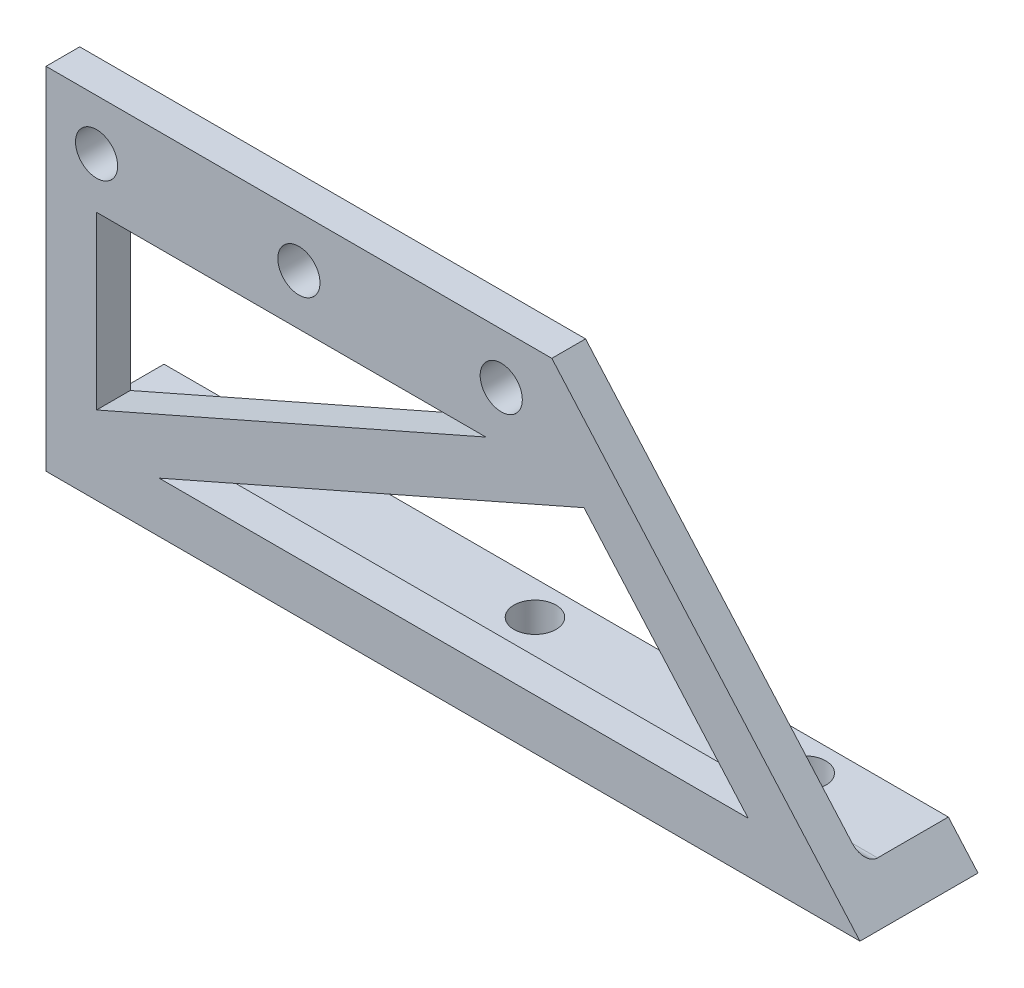
ISO-10303-21;
HEADER;
FILE_DESCRIPTION(('STEP AP214'),'2;1');
FILE_NAME('part.step','',(''),(''),'','','');
FILE_SCHEMA(('AUTOMOTIVE_DESIGN { 1 0 10303 214 1 1 1 1 }'));
ENDSEC;
DATA;
#1=APPLICATION_CONTEXT('core data for automotive mechanical design processes');
#2=APPLICATION_PROTOCOL_DEFINITION('international standard','automotive_design',2000,#1);
#3=PRODUCT_CONTEXT('',#1,'mechanical');
#4=PRODUCT('Part','Part','',(#3));
#5=PRODUCT_RELATED_PRODUCT_CATEGORY('part','',(#4));
#6=PRODUCT_DEFINITION_FORMATION('','',#4);
#7=PRODUCT_DEFINITION_CONTEXT('part definition',#1,'design');
#8=PRODUCT_DEFINITION('design','',#6,#7);
#9=PRODUCT_DEFINITION_SHAPE('','',#8);
#10=(LENGTH_UNIT() NAMED_UNIT(*) SI_UNIT(.MILLI.,.METRE.));
#11=(NAMED_UNIT(*) PLANE_ANGLE_UNIT() SI_UNIT($,.RADIAN.));
#12=(NAMED_UNIT(*) SI_UNIT($,.STERADIAN.) SOLID_ANGLE_UNIT());
#13=UNCERTAINTY_MEASURE_WITH_UNIT(LENGTH_MEASURE(1.E-05),#10,'distance_accuracy_value','');
#14=(GEOMETRIC_REPRESENTATION_CONTEXT(3) GLOBAL_UNCERTAINTY_ASSIGNED_CONTEXT((#13)) GLOBAL_UNIT_ASSIGNED_CONTEXT((#10,
#11,#12)) REPRESENTATION_CONTEXT('',''));
#15=CARTESIAN_POINT('',(0.,0.,0.));
#16=DIRECTION('',(0.,0.,1.));
#17=DIRECTION('',(1.,0.,0.));
#18=AXIS2_PLACEMENT_3D('',#15,#16,#17);
#19=CARTESIAN_POINT('',(153.277121283848,6.35,-15.875));
#20=DIRECTION('',(0.,0.,-1.));
#21=DIRECTION('',(-1.,0.,0.));
#22=AXIS2_PLACEMENT_3D('',#19,#20,#21);
#23=PLANE('',#22);
#24=DIRECTION('',(1.,0.,0.));
#25=VECTOR('',#24,1.);
#26=CARTESIAN_POINT('',(153.277121283848,6.35,-15.875));
#27=LINE('',#26,#25);
#28=CARTESIAN_POINT('',(0.,6.35,-15.875));
#29=VERTEX_POINT('',#28);
#30=CARTESIAN_POINT('',(147.69759039117,6.35,-15.875));
#31=VERTEX_POINT('',#30);
#32=EDGE_CURVE('E143',#29,#31,#27,.T.);
#33=ORIENTED_EDGE('',*,*,#32,.T.);
#34=DIRECTION('',(-0.660063065152085,0.751210190307636,0.));
#35=VECTOR('',#34,1.);
#36=CARTESIAN_POINT('',(153.277121283848,0.,-15.875));
#37=LINE('',#36,#35);
#38=CARTESIAN_POINT('',(153.277121283848,0.,-15.875));
#39=VERTEX_POINT('',#38);
#40=EDGE_CURVE('E50',#39,#31,#37,.T.);
#41=ORIENTED_EDGE('',*,*,#40,.F.);
#42=DIRECTION('',(1.,0.,0.));
#43=VECTOR('',#42,1.);
#44=CARTESIAN_POINT('',(153.277121283848,0.,-15.875));
#45=LINE('',#44,#43);
#46=CARTESIAN_POINT('',(0.,0.,-15.875));
#47=VERTEX_POINT('',#46);
#48=EDGE_CURVE('E141',#47,#39,#45,.T.);
#49=ORIENTED_EDGE('',*,*,#48,.F.);
#50=DIRECTION('',(0.,-1.,0.));
#51=VECTOR('',#50,1.);
#52=CARTESIAN_POINT('',(0.,6.35,-15.875));
#53=LINE('',#52,#51);
#54=EDGE_CURVE('E161',#29,#47,#53,.T.);
#55=ORIENTED_EDGE('',*,*,#54,.F.);
#56=EDGE_LOOP('',(#33,#41,#49,#55));
#57=FACE_BOUND('',#56,.T.);
#58=ADVANCED_FACE('F35',(#57),#23,.T.);
#59=CARTESIAN_POINT('',(0.,6.35,0.));
#60=DIRECTION('',(0.,1.,0.));
#61=DIRECTION('',(0.,0.,1.));
#62=AXIS2_PLACEMENT_3D('',#59,#60,#61);
#63=PLANE('',#62);
#64=CARTESIAN_POINT('',(25.4,6.35,-9.52500000000002));
#65=DIRECTION('',(0.,-1.,0.));
#66=DIRECTION('',(0.,0.,-1.));
#67=AXIS2_PLACEMENT_3D('',#64,#65,#66);
#68=CIRCLE('',#67,3.96875);
#69=CARTESIAN_POINT('',(25.4,6.35,-13.49375));
#70=VERTEX_POINT('',#69);
#71=EDGE_CURVE('E152',#70,#70,#68,.T.);
#72=ORIENTED_EDGE('',*,*,#71,.T.);
#73=EDGE_LOOP('',(#72));
#74=FACE_BOUND('',#73,.T.);
#75=CARTESIAN_POINT('',(76.2,6.35,-9.52500000000002));
#76=DIRECTION('',(0.,-1.,0.));
#77=DIRECTION('',(0.,0.,-1.));
#78=AXIS2_PLACEMENT_3D('',#75,#76,#77);
#79=CIRCLE('',#78,3.96875);
#80=CARTESIAN_POINT('',(76.2,6.35,-13.49375));
#81=VERTEX_POINT('',#80);
#82=EDGE_CURVE('E481',#81,#81,#79,.T.);
#83=ORIENTED_EDGE('',*,*,#82,.T.);
#84=EDGE_LOOP('',(#83));
#85=FACE_BOUND('',#84,.T.);
#86=CARTESIAN_POINT('',(127.,6.35,-9.52500000000002));
#87=DIRECTION('',(0.,-1.,0.));
#88=DIRECTION('',(0.,0.,-1.));
#89=AXIS2_PLACEMENT_3D('',#86,#87,#88);
#90=CIRCLE('',#89,3.96874999999999);
#91=CARTESIAN_POINT('',(127.,6.35,-13.49375));
#92=VERTEX_POINT('',#91);
#93=EDGE_CURVE('E486',#92,#92,#90,.T.);
#94=ORIENTED_EDGE('',*,*,#93,.T.);
#95=EDGE_LOOP('',(#94));
#96=FACE_BOUND('',#95,.T.);
#97=DIRECTION('',(-1.,0.,0.));
#98=VECTOR('',#97,1.);
#99=CARTESIAN_POINT('',(147.69759039117,6.35,-2.54));
#100=LINE('',#99,#98);
#101=CARTESIAN_POINT('',(0.,6.35,-2.54));
#102=VERTEX_POINT('',#101);
#103=CARTESIAN_POINT('',(147.69759039117,6.35,-2.54));
#104=VERTEX_POINT('',#103);
#105=EDGE_CURVE('E250',#102,#104,#100,.F.);
#106=ORIENTED_EDGE('',*,*,#105,.T.);
#107=DIRECTION('',(0.,0.,-1.));
#108=VECTOR('',#107,1.);
#109=CARTESIAN_POINT('',(147.69759039117,6.35,0.));
#110=LINE('',#109,#108);
#111=EDGE_CURVE('E144',#104,#31,#110,.T.);
#112=ORIENTED_EDGE('',*,*,#111,.T.);
#113=ORIENTED_EDGE('',*,*,#32,.F.);
#114=DIRECTION('',(0.,0.,-1.));
#115=VECTOR('',#114,1.);
#116=CARTESIAN_POINT('',(0.,6.35,0.));
#117=LINE('',#116,#115);
#118=EDGE_CURVE('E151',#102,#29,#117,.T.);
#119=ORIENTED_EDGE('',*,*,#118,.F.);
#120=EDGE_LOOP('',(#106,#112,#113,#119));
#121=FACE_BOUND('',#120,.T.);
#122=ADVANCED_FACE('F281',(#74,#85,#96,#121),#63,.T.);
#123=CARTESIAN_POINT('',(0.,0.,0.));
#124=DIRECTION('',(0.,0.,-1.));
#125=DIRECTION('',(-1.,0.,0.));
#126=AXIS2_PLACEMENT_3D('',#123,#124,#125);
#127=PLANE('',#126);
#128=DIRECTION('',(-0.91541039740455,-0.402521806022535,0.));
#129=VECTOR('',#128,1.);
#130=CARTESIAN_POINT('',(21.2908175087575,9.52499999999998,0.));
#131=LINE('',#130,#129);
#132=CARTESIAN_POINT('',(101.311219354226,44.7113565902367,0.));
#133=VERTEX_POINT('',#132);
#134=CARTESIAN_POINT('',(21.2908175087575,9.52499999999998,0.));
#135=VERTEX_POINT('',#134);
#136=EDGE_CURVE('E167',#133,#135,#131,.T.);
#137=ORIENTED_EDGE('',*,*,#136,.T.);
#138=DIRECTION('',(1.,0.,0.));
#139=VECTOR('',#138,1.);
#140=CARTESIAN_POINT('',(132.228284487454,9.525,0.));
#141=LINE('',#140,#139);
#142=CARTESIAN_POINT('',(132.228284487454,9.525,0.));
#143=VERTEX_POINT('',#142);
#144=EDGE_CURVE('E163',#135,#143,#141,.T.);
#145=ORIENTED_EDGE('',*,*,#144,.T.);
#146=DIRECTION('',(-0.660063065152084,0.751210190307637,0.));
#147=VECTOR('',#146,1.);
#148=CARTESIAN_POINT('',(101.311219354226,44.7113565902367,0.));
#149=LINE('',#148,#147);
#150=EDGE_CURVE('E175',#143,#133,#149,.T.);
#151=ORIENTED_EDGE('',*,*,#150,.T.);
#152=EDGE_LOOP('',(#137,#145,#151));
#153=FACE_BOUND('',#152,.T.);
#154=CARTESIAN_POINT('',(85.725,56.515,0.));
#155=DIRECTION('',(0.,0.,1.));
#156=DIRECTION('',(1.,0.,0.));
#157=AXIS2_PLACEMENT_3D('',#154,#155,#156);
#158=CIRCLE('',#157,3.96875000000001);
#159=CARTESIAN_POINT('',(89.69375,56.515,0.));
#160=VERTEX_POINT('',#159);
#161=EDGE_CURVE('E211',#160,#160,#158,.T.);
#162=ORIENTED_EDGE('',*,*,#161,.T.);
#163=EDGE_LOOP('',(#162));
#164=FACE_BOUND('',#163,.T.);
#165=CARTESIAN_POINT('',(9.52500000000001,56.515,0.));
#166=DIRECTION('',(0.,0.,1.));
#167=DIRECTION('',(1.,0.,0.));
#168=AXIS2_PLACEMENT_3D('',#165,#166,#167);
#169=CIRCLE('',#168,3.96875000000001);
#170=CARTESIAN_POINT('',(13.49375,56.515,0.));
#171=VERTEX_POINT('',#170);
#172=EDGE_CURVE('E221',#171,#171,#169,.T.);
#173=ORIENTED_EDGE('',*,*,#172,.T.);
#174=EDGE_LOOP('',(#173));
#175=FACE_BOUND('',#174,.T.);
#176=CARTESIAN_POINT('',(47.625,56.515,0.));
#177=DIRECTION('',(0.,0.,1.));
#178=DIRECTION('',(1.,0.,0.));
#179=AXIS2_PLACEMENT_3D('',#176,#177,#178);
#180=CIRCLE('',#179,3.96875);
#181=CARTESIAN_POINT('',(51.59375,56.515,0.));
#182=VERTEX_POINT('',#181);
#183=EDGE_CURVE('E215',#182,#182,#180,.T.);
#184=ORIENTED_EDGE('',*,*,#183,.T.);
#185=EDGE_LOOP('',(#184));
#186=FACE_BOUND('',#185,.T.);
#187=DIRECTION('',(0.,-1.,0.));
#188=VECTOR('',#187,1.);
#189=CARTESIAN_POINT('',(9.52500000000001,14.7565353863377,0.));
#190=LINE('',#189,#188);
#191=CARTESIAN_POINT('',(9.525,46.99,0.));
#192=VERTEX_POINT('',#191);
#193=CARTESIAN_POINT('',(9.52500000000001,14.7565353863377,0.));
#194=VERTEX_POINT('',#193);
#195=EDGE_CURVE('E191',#192,#194,#190,.T.);
#196=ORIENTED_EDGE('',*,*,#195,.T.);
#197=DIRECTION('',(0.91541039740455,0.402521806022535,0.));
#198=VECTOR('',#197,1.);
#199=CARTESIAN_POINT('',(82.8299693463469,46.99,0.));
#200=LINE('',#199,#198);
#201=CARTESIAN_POINT('',(82.8299693463469,46.99,0.));
#202=VERTEX_POINT('',#201);
#203=EDGE_CURVE('E187',#194,#202,#200,.T.);
#204=ORIENTED_EDGE('',*,*,#203,.T.);
#205=DIRECTION('',(-1.,0.,0.));
#206=VECTOR('',#205,1.);
#207=CARTESIAN_POINT('',(9.525,46.99,0.));
#208=LINE('',#207,#206);
#209=EDGE_CURVE('E199',#202,#192,#208,.T.);
#210=ORIENTED_EDGE('',*,*,#209,.T.);
#211=EDGE_LOOP('',(#196,#204,#210));
#212=FACE_BOUND('',#211,.T.);
#213=DIRECTION('',(-0.660063065152084,0.751210190307636,0.));
#214=VECTOR('',#213,1.);
#215=CARTESIAN_POINT('',(95.25,66.04,0.));
#216=LINE('',#215,#214);
#217=CARTESIAN_POINT('',(145.465778034099,8.89000000000001,0.));
#218=VERTEX_POINT('',#217);
#219=CARTESIAN_POINT('',(95.25,66.04,0.));
#220=VERTEX_POINT('',#219);
#221=EDGE_CURVE('E227',#218,#220,#216,.T.);
#222=ORIENTED_EDGE('',*,*,#221,.F.);
#223=DIRECTION('',(-1.,0.,0.));
#224=VECTOR('',#223,1.);
#225=CARTESIAN_POINT('',(0.,8.89,0.));
#226=LINE('',#225,#224);
#227=CARTESIAN_POINT('',(0.,8.89,0.));
#228=VERTEX_POINT('',#227);
#229=EDGE_CURVE('E134',#218,#228,#226,.T.);
#230=ORIENTED_EDGE('',*,*,#229,.T.);
#231=DIRECTION('',(0.,-1.,0.));
#232=VECTOR('',#231,1.);
#233=CARTESIAN_POINT('',(0.,0.,0.));
#234=LINE('',#233,#232);
#235=CARTESIAN_POINT('',(0.,66.04,0.));
#236=VERTEX_POINT('',#235);
#237=EDGE_CURVE('E232',#236,#228,#234,.T.);
#238=ORIENTED_EDGE('',*,*,#237,.F.);
#239=DIRECTION('',(-1.,0.,0.));
#240=VECTOR('',#239,1.);
#241=CARTESIAN_POINT('',(0.,66.04,0.));
#242=LINE('',#241,#240);
#243=EDGE_CURVE('E239',#220,#236,#242,.T.);
#244=ORIENTED_EDGE('',*,*,#243,.F.);
#245=EDGE_LOOP('',(#222,#230,#238,#244));
#246=FACE_BOUND('',#245,.T.);
#247=ADVANCED_FACE('F260',(#153,#164,#175,#186,#212,#246),#127,.T.);
#248=CARTESIAN_POINT('',(0.,0.,6.35));
#249=DIRECTION('',(0.,0.,-1.));
#250=DIRECTION('',(-1.,0.,0.));
#251=AXIS2_PLACEMENT_3D('',#248,#249,#250);
#252=PLANE('',#251);
#253=DIRECTION('',(0.91541039740455,0.402521806022535,0.));
#254=VECTOR('',#253,1.);
#255=CARTESIAN_POINT('',(82.8299693463469,46.99,6.35));
#256=LINE('',#255,#254);
#257=CARTESIAN_POINT('',(9.52500000000001,14.7565353863377,6.35));
#258=VERTEX_POINT('',#257);
#259=CARTESIAN_POINT('',(82.8299693463469,46.99,6.35));
#260=VERTEX_POINT('',#259);
#261=EDGE_CURVE('E188',#258,#260,#256,.T.);
#262=ORIENTED_EDGE('',*,*,#261,.F.);
#263=DIRECTION('',(0.,-1.,0.));
#264=VECTOR('',#263,1.);
#265=CARTESIAN_POINT('',(9.52500000000001,14.7565353863377,6.35));
#266=LINE('',#265,#264);
#267=CARTESIAN_POINT('',(9.525,46.99,6.35));
#268=VERTEX_POINT('',#267);
#269=EDGE_CURVE('E194',#268,#258,#266,.T.);
#270=ORIENTED_EDGE('',*,*,#269,.F.);
#271=DIRECTION('',(-1.,0.,0.));
#272=VECTOR('',#271,1.);
#273=CARTESIAN_POINT('',(9.525,46.99,6.35));
#274=LINE('',#273,#272);
#275=EDGE_CURVE('E190',#260,#268,#274,.T.);
#276=ORIENTED_EDGE('',*,*,#275,.F.);
#277=EDGE_LOOP('',(#262,#270,#276));
#278=FACE_BOUND('',#277,.T.);
#279=CARTESIAN_POINT('',(47.625,56.515,6.35));
#280=DIRECTION('',(0.,0.,1.));
#281=DIRECTION('',(1.,0.,0.));
#282=AXIS2_PLACEMENT_3D('',#279,#280,#281);
#283=CIRCLE('',#282,3.96875);
#284=CARTESIAN_POINT('',(51.59375,56.515,6.35));
#285=VERTEX_POINT('',#284);
#286=EDGE_CURVE('E218',#285,#285,#283,.T.);
#287=ORIENTED_EDGE('',*,*,#286,.F.);
#288=EDGE_LOOP('',(#287));
#289=FACE_BOUND('',#288,.T.);
#290=DIRECTION('',(1.,0.,0.));
#291=VECTOR('',#290,1.);
#292=CARTESIAN_POINT('',(153.277121283848,0.,6.35));
#293=LINE('',#292,#291);
#294=CARTESIAN_POINT('',(0.,0.,6.35));
#295=VERTEX_POINT('',#294);
#296=CARTESIAN_POINT('',(153.277121283848,0.,6.35));
#297=VERTEX_POINT('',#296);
#298=EDGE_CURVE('E230',#295,#297,#293,.T.);
#299=ORIENTED_EDGE('',*,*,#298,.T.);
#300=DIRECTION('',(-0.660063065152084,0.751210190307636,0.));
#301=VECTOR('',#300,1.);
#302=CARTESIAN_POINT('',(95.25,66.04,6.35));
#303=LINE('',#302,#301);
#304=CARTESIAN_POINT('',(95.25,66.04,6.35));
#305=VERTEX_POINT('',#304);
#306=EDGE_CURVE('E129',#297,#305,#303,.T.);
#307=ORIENTED_EDGE('',*,*,#306,.T.);
#308=DIRECTION('',(-1.,0.,0.));
#309=VECTOR('',#308,1.);
#310=CARTESIAN_POINT('',(0.,66.04,6.35));
#311=LINE('',#310,#309);
#312=CARTESIAN_POINT('',(0.,66.04,6.35));
#313=VERTEX_POINT('',#312);
#314=EDGE_CURVE('E234',#305,#313,#311,.T.);
#315=ORIENTED_EDGE('',*,*,#314,.T.);
#316=DIRECTION('',(0.,-1.,0.));
#317=VECTOR('',#316,1.);
#318=CARTESIAN_POINT('',(0.,0.,6.35));
#319=LINE('',#318,#317);
#320=EDGE_CURVE('E236',#313,#295,#319,.T.);
#321=ORIENTED_EDGE('',*,*,#320,.T.);
#322=EDGE_LOOP('',(#299,#307,#315,#321));
#323=FACE_BOUND('',#322,.T.);
#324=CARTESIAN_POINT('',(9.52500000000001,56.515,6.35));
#325=DIRECTION('',(0.,0.,1.));
#326=DIRECTION('',(1.,0.,0.));
#327=AXIS2_PLACEMENT_3D('',#324,#325,#326);
#328=CIRCLE('',#327,3.96875000000001);
#329=CARTESIAN_POINT('',(13.49375,56.515,6.35));
#330=VERTEX_POINT('',#329);
#331=EDGE_CURVE('E224',#330,#330,#328,.T.);
#332=ORIENTED_EDGE('',*,*,#331,.F.);
#333=EDGE_LOOP('',(#332));
#334=FACE_BOUND('',#333,.T.);
#335=CARTESIAN_POINT('',(85.725,56.515,6.35));
#336=DIRECTION('',(0.,0.,1.));
#337=DIRECTION('',(1.,0.,0.));
#338=AXIS2_PLACEMENT_3D('',#335,#336,#337);
#339=CIRCLE('',#338,3.96875000000001);
#340=CARTESIAN_POINT('',(89.69375,56.515,6.35));
#341=VERTEX_POINT('',#340);
#342=EDGE_CURVE('E212',#341,#341,#339,.T.);
#343=ORIENTED_EDGE('',*,*,#342,.F.);
#344=EDGE_LOOP('',(#343));
#345=FACE_BOUND('',#344,.T.);
#346=DIRECTION('',(1.,0.,0.));
#347=VECTOR('',#346,1.);
#348=CARTESIAN_POINT('',(132.228284487454,9.525,6.35));
#349=LINE('',#348,#347);
#350=CARTESIAN_POINT('',(21.2908175087575,9.52499999999998,6.35));
#351=VERTEX_POINT('',#350);
#352=CARTESIAN_POINT('',(132.228284487454,9.525,6.35));
#353=VERTEX_POINT('',#352);
#354=EDGE_CURVE('E164',#351,#353,#349,.T.);
#355=ORIENTED_EDGE('',*,*,#354,.F.);
#356=DIRECTION('',(-0.91541039740455,-0.402521806022535,0.));
#357=VECTOR('',#356,1.);
#358=CARTESIAN_POINT('',(21.2908175087575,9.52499999999998,6.35));
#359=LINE('',#358,#357);
#360=CARTESIAN_POINT('',(101.311219354226,44.7113565902367,6.35));
#361=VERTEX_POINT('',#360);
#362=EDGE_CURVE('E170',#361,#351,#359,.T.);
#363=ORIENTED_EDGE('',*,*,#362,.F.);
#364=DIRECTION('',(-0.660063065152084,0.751210190307637,0.));
#365=VECTOR('',#364,1.);
#366=CARTESIAN_POINT('',(101.311219354226,44.7113565902367,6.35));
#367=LINE('',#366,#365);
#368=EDGE_CURVE('E166',#353,#361,#367,.T.);
#369=ORIENTED_EDGE('',*,*,#368,.F.);
#370=EDGE_LOOP('',(#355,#363,#369));
#371=FACE_BOUND('',#370,.T.);
#372=ADVANCED_FACE('F327',(#278,#289,#323,#334,#345,#371),#252,.F.);
#373=CARTESIAN_POINT('',(153.277121283848,0.,6.35));
#374=DIRECTION('',(0.,1.,0.));
#375=DIRECTION('',(0.,0.,1.));
#376=AXIS2_PLACEMENT_3D('',#373,#374,#375);
#377=PLANE('',#376);
#378=DIRECTION('',(0.,0.,-1.));
#379=VECTOR('',#378,1.);
#380=CARTESIAN_POINT('',(0.,0.,6.35));
#381=LINE('',#380,#379);
#382=EDGE_CURVE('E149',#295,#47,#381,.T.);
#383=ORIENTED_EDGE('',*,*,#382,.T.);
#384=ORIENTED_EDGE('',*,*,#48,.T.);
#385=DIRECTION('',(0.,0.,-1.));
#386=VECTOR('',#385,1.);
#387=CARTESIAN_POINT('',(153.277121283848,0.,6.35));
#388=LINE('',#387,#386);
#389=EDGE_CURVE('E126',#297,#39,#388,.T.);
#390=ORIENTED_EDGE('',*,*,#389,.F.);
#391=ORIENTED_EDGE('',*,*,#298,.F.);
#392=EDGE_LOOP('',(#383,#384,#390,#391));
#393=FACE_BOUND('',#392,.T.);
#394=CARTESIAN_POINT('',(127.,0.,-9.52500000000002));
#395=DIRECTION('',(0.,-1.,0.));
#396=DIRECTION('',(0.,0.,-1.));
#397=AXIS2_PLACEMENT_3D('',#394,#395,#396);
#398=CIRCLE('',#397,3.96874999999999);
#399=CARTESIAN_POINT('',(127.,0.,-13.49375));
#400=VERTEX_POINT('',#399);
#401=EDGE_CURVE('E490',#400,#400,#398,.T.);
#402=ORIENTED_EDGE('',*,*,#401,.F.);
#403=EDGE_LOOP('',(#402));
#404=FACE_BOUND('',#403,.T.);
#405=CARTESIAN_POINT('',(76.2,0.,-9.52500000000002));
#406=DIRECTION('',(0.,-1.,0.));
#407=DIRECTION('',(0.,0.,-1.));
#408=AXIS2_PLACEMENT_3D('',#405,#406,#407);
#409=CIRCLE('',#408,3.96875);
#410=CARTESIAN_POINT('',(76.2,0.,-13.49375));
#411=VERTEX_POINT('',#410);
#412=EDGE_CURVE('E484',#411,#411,#409,.T.);
#413=ORIENTED_EDGE('',*,*,#412,.F.);
#414=EDGE_LOOP('',(#413));
#415=FACE_BOUND('',#414,.T.);
#416=CARTESIAN_POINT('',(25.4,0.,-9.52500000000002));
#417=DIRECTION('',(0.,-1.,0.));
#418=DIRECTION('',(0.,0.,-1.));
#419=AXIS2_PLACEMENT_3D('',#416,#417,#418);
#420=CIRCLE('',#419,3.96875);
#421=CARTESIAN_POINT('',(25.4,0.,-13.49375));
#422=VERTEX_POINT('',#421);
#423=EDGE_CURVE('E156',#422,#422,#420,.T.);
#424=ORIENTED_EDGE('',*,*,#423,.F.);
#425=EDGE_LOOP('',(#424));
#426=FACE_BOUND('',#425,.T.);
#427=ADVANCED_FACE('F146',(#393,#404,#415,#426),#377,.F.);
#428=CARTESIAN_POINT('',(95.25,66.04,6.35));
#429=DIRECTION('',(-0.751210190307636,-0.660063065152084,0.));
#430=DIRECTION('',(0.660063065152084,-0.751210190307637,0.));
#431=AXIS2_PLACEMENT_3D('',#428,#429,#430);
#432=PLANE('',#431);
#433=CARTESIAN_POINT('',(145.465778034099,8.89,-2.54));
#434=DIRECTION('',(-0.751210190307636,-0.660063065152084,0.));
#435=DIRECTION('',(0.660063065152084,-0.751210190307637,0.));
#436=AXIS2_PLACEMENT_3D('',#433,#434,#435);
#437=ELLIPSE('',#436,3.38121078863403,2.54);
#438=EDGE_CURVE('E11',#104,#218,#437,.T.);
#439=ORIENTED_EDGE('',*,*,#438,.T.);
#440=ORIENTED_EDGE('',*,*,#221,.T.);
#441=DIRECTION('',(0.,0.,-1.));
#442=VECTOR('',#441,1.);
#443=CARTESIAN_POINT('',(95.25,66.04,6.35));
#444=LINE('',#443,#442);
#445=EDGE_CURVE('E135',#305,#220,#444,.T.);
#446=ORIENTED_EDGE('',*,*,#445,.F.);
#447=ORIENTED_EDGE('',*,*,#306,.F.);
#448=ORIENTED_EDGE('',*,*,#389,.T.);
#449=ORIENTED_EDGE('',*,*,#40,.T.);
#450=ORIENTED_EDGE('',*,*,#111,.F.);
#451=EDGE_LOOP('',(#439,#440,#446,#447,#448,#449,#450));
#452=FACE_BOUND('',#451,.T.);
#453=ADVANCED_FACE('F127',(#452),#432,.F.);
#454=CARTESIAN_POINT('',(0.,66.04,6.35));
#455=DIRECTION('',(0.,-1.,0.));
#456=DIRECTION('',(0.,0.,-1.));
#457=AXIS2_PLACEMENT_3D('',#454,#455,#456);
#458=PLANE('',#457);
#459=ORIENTED_EDGE('',*,*,#243,.T.);
#460=DIRECTION('',(0.,0.,-1.));
#461=VECTOR('',#460,1.);
#462=CARTESIAN_POINT('',(0.,66.04,6.35));
#463=LINE('',#462,#461);
#464=EDGE_CURVE('E267',#313,#236,#463,.T.);
#465=ORIENTED_EDGE('',*,*,#464,.F.);
#466=ORIENTED_EDGE('',*,*,#314,.F.);
#467=ORIENTED_EDGE('',*,*,#445,.T.);
#468=EDGE_LOOP('',(#459,#465,#466,#467));
#469=FACE_BOUND('',#468,.T.);
#470=ADVANCED_FACE('F271',(#469),#458,.F.);
#471=CARTESIAN_POINT('',(0.,0.,6.35));
#472=DIRECTION('',(1.,0.,0.));
#473=DIRECTION('',(0.,0.,-1.));
#474=AXIS2_PLACEMENT_3D('',#471,#472,#473);
#475=PLANE('',#474);
#476=ORIENTED_EDGE('',*,*,#237,.T.);
#477=CARTESIAN_POINT('',(0.,8.89,-2.54));
#478=DIRECTION('',(1.,0.,0.));
#479=DIRECTION('',(0.,0.,-1.));
#480=AXIS2_PLACEMENT_3D('',#477,#478,#479);
#481=CIRCLE('',#480,2.54);
#482=EDGE_CURVE('E43',#228,#102,#481,.T.);
#483=ORIENTED_EDGE('',*,*,#482,.T.);
#484=ORIENTED_EDGE('',*,*,#118,.T.);
#485=ORIENTED_EDGE('',*,*,#54,.T.);
#486=ORIENTED_EDGE('',*,*,#382,.F.);
#487=ORIENTED_EDGE('',*,*,#320,.F.);
#488=ORIENTED_EDGE('',*,*,#464,.T.);
#489=EDGE_LOOP('',(#476,#483,#484,#485,#486,#487,#488));
#490=FACE_BOUND('',#489,.T.);
#491=ADVANCED_FACE('F264',(#490),#475,.F.);
#492=CARTESIAN_POINT('',(9.52500000000001,56.515,6.35));
#493=DIRECTION('',(0.,0.,-1.));
#494=DIRECTION('',(-1.,0.,0.));
#495=AXIS2_PLACEMENT_3D('',#492,#493,#494);
#496=CYLINDRICAL_SURFACE('',#495,3.96875000000001);
#497=ORIENTED_EDGE('',*,*,#331,.T.);
#498=EDGE_LOOP('',(#497));
#499=FACE_BOUND('',#498,.T.);
#500=ORIENTED_EDGE('',*,*,#172,.F.);
#501=EDGE_LOOP('',(#500));
#502=FACE_BOUND('',#501,.T.);
#503=ADVANCED_FACE('F322',(#499,#502),#496,.F.);
#504=CARTESIAN_POINT('',(47.625,56.515,6.35));
#505=DIRECTION('',(0.,0.,-1.));
#506=DIRECTION('',(-1.,0.,0.));
#507=AXIS2_PLACEMENT_3D('',#504,#505,#506);
#508=CYLINDRICAL_SURFACE('',#507,3.96875);
#509=ORIENTED_EDGE('',*,*,#286,.T.);
#510=EDGE_LOOP('',(#509));
#511=FACE_BOUND('',#510,.T.);
#512=ORIENTED_EDGE('',*,*,#183,.F.);
#513=EDGE_LOOP('',(#512));
#514=FACE_BOUND('',#513,.T.);
#515=ADVANCED_FACE('F318',(#511,#514),#508,.F.);
#516=CARTESIAN_POINT('',(85.725,56.515,6.35));
#517=DIRECTION('',(0.,0.,-1.));
#518=DIRECTION('',(-1.,0.,0.));
#519=AXIS2_PLACEMENT_3D('',#516,#517,#518);
#520=CYLINDRICAL_SURFACE('',#519,3.96875000000001);
#521=ORIENTED_EDGE('',*,*,#342,.T.);
#522=EDGE_LOOP('',(#521));
#523=FACE_BOUND('',#522,.T.);
#524=ORIENTED_EDGE('',*,*,#161,.F.);
#525=EDGE_LOOP('',(#524));
#526=FACE_BOUND('',#525,.T.);
#527=ADVANCED_FACE('F314',(#523,#526),#520,.F.);
#528=CARTESIAN_POINT('',(82.8299693463469,46.99,6.35));
#529=DIRECTION('',(-0.402521806022535,0.915410397404551,0.));
#530=DIRECTION('',(-0.91541039740455,-0.402521806022535,0.));
#531=AXIS2_PLACEMENT_3D('',#528,#529,#530);
#532=PLANE('',#531);
#533=ORIENTED_EDGE('',*,*,#203,.F.);
#534=DIRECTION('',(0.,0.,-1.));
#535=VECTOR('',#534,1.);
#536=CARTESIAN_POINT('',(9.52500000000001,14.7565353863377,6.35));
#537=LINE('',#536,#535);
#538=EDGE_CURVE('E196',#258,#194,#537,.T.);
#539=ORIENTED_EDGE('',*,*,#538,.F.);
#540=ORIENTED_EDGE('',*,*,#261,.T.);
#541=DIRECTION('',(0.,0.,-1.));
#542=VECTOR('',#541,1.);
#543=CARTESIAN_POINT('',(82.8299693463469,46.99,6.35));
#544=LINE('',#543,#542);
#545=EDGE_CURVE('E208',#260,#202,#544,.T.);
#546=ORIENTED_EDGE('',*,*,#545,.T.);
#547=EDGE_LOOP('',(#533,#539,#540,#546));
#548=FACE_BOUND('',#547,.T.);
#549=ADVANCED_FACE('F310',(#548),#532,.T.);
#550=CARTESIAN_POINT('',(9.525,46.99,6.35));
#551=DIRECTION('',(0.,-1.,0.));
#552=DIRECTION('',(0.,0.,-1.));
#553=AXIS2_PLACEMENT_3D('',#550,#551,#552);
#554=PLANE('',#553);
#555=ORIENTED_EDGE('',*,*,#209,.F.);
#556=ORIENTED_EDGE('',*,*,#545,.F.);
#557=ORIENTED_EDGE('',*,*,#275,.T.);
#558=DIRECTION('',(0.,0.,-1.));
#559=VECTOR('',#558,1.);
#560=CARTESIAN_POINT('',(9.525,46.99,6.35));
#561=LINE('',#560,#559);
#562=EDGE_CURVE('E206',#268,#192,#561,.T.);
#563=ORIENTED_EDGE('',*,*,#562,.T.);
#564=EDGE_LOOP('',(#555,#556,#557,#563));
#565=FACE_BOUND('',#564,.T.);
#566=ADVANCED_FACE('F306',(#565),#554,.T.);
#567=CARTESIAN_POINT('',(9.52500000000001,14.7565353863377,6.35));
#568=DIRECTION('',(1.,0.,0.));
#569=DIRECTION('',(0.,1.,0.));
#570=AXIS2_PLACEMENT_3D('',#567,#568,#569);
#571=PLANE('',#570);
#572=ORIENTED_EDGE('',*,*,#195,.F.);
#573=ORIENTED_EDGE('',*,*,#562,.F.);
#574=ORIENTED_EDGE('',*,*,#269,.T.);
#575=ORIENTED_EDGE('',*,*,#538,.T.);
#576=EDGE_LOOP('',(#572,#573,#574,#575));
#577=FACE_BOUND('',#576,.T.);
#578=ADVANCED_FACE('F302',(#577),#571,.T.);
#579=CARTESIAN_POINT('',(132.228284487454,9.525,6.35));
#580=DIRECTION('',(0.,1.,0.));
#581=DIRECTION('',(-1.,0.,0.));
#582=AXIS2_PLACEMENT_3D('',#579,#580,#581);
#583=PLANE('',#582);
#584=ORIENTED_EDGE('',*,*,#144,.F.);
#585=DIRECTION('',(0.,0.,-1.));
#586=VECTOR('',#585,1.);
#587=CARTESIAN_POINT('',(21.2908175087575,9.52499999999998,6.35));
#588=LINE('',#587,#586);
#589=EDGE_CURVE('E172',#351,#135,#588,.T.);
#590=ORIENTED_EDGE('',*,*,#589,.F.);
#591=ORIENTED_EDGE('',*,*,#354,.T.);
#592=DIRECTION('',(0.,0.,-1.));
#593=VECTOR('',#592,1.);
#594=CARTESIAN_POINT('',(132.228284487454,9.525,6.35));
#595=LINE('',#594,#593);
#596=EDGE_CURVE('E184',#353,#143,#595,.T.);
#597=ORIENTED_EDGE('',*,*,#596,.T.);
#598=EDGE_LOOP('',(#584,#590,#591,#597));
#599=FACE_BOUND('',#598,.T.);
#600=ADVANCED_FACE('F298',(#599),#583,.T.);
#601=CARTESIAN_POINT('',(101.311219354226,44.7113565902367,6.35));
#602=DIRECTION('',(-0.751210190307636,-0.660063065152084,0.));
#603=DIRECTION('',(0.660063065152084,-0.751210190307637,0.));
#604=AXIS2_PLACEMENT_3D('',#601,#602,#603);
#605=PLANE('',#604);
#606=ORIENTED_EDGE('',*,*,#150,.F.);
#607=ORIENTED_EDGE('',*,*,#596,.F.);
#608=ORIENTED_EDGE('',*,*,#368,.T.);
#609=DIRECTION('',(0.,0.,-1.));
#610=VECTOR('',#609,1.);
#611=CARTESIAN_POINT('',(101.311219354226,44.7113565902367,6.35));
#612=LINE('',#611,#610);
#613=EDGE_CURVE('E182',#361,#133,#612,.T.);
#614=ORIENTED_EDGE('',*,*,#613,.T.);
#615=EDGE_LOOP('',(#606,#607,#608,#614));
#616=FACE_BOUND('',#615,.T.);
#617=ADVANCED_FACE('F294',(#616),#605,.T.);
#618=CARTESIAN_POINT('',(21.2908175087575,9.52499999999998,6.35));
#619=DIRECTION('',(0.402521806022535,-0.915410397404551,0.));
#620=DIRECTION('',(0.91541039740455,0.402521806022535,0.));
#621=AXIS2_PLACEMENT_3D('',#618,#619,#620);
#622=PLANE('',#621);
#623=ORIENTED_EDGE('',*,*,#136,.F.);
#624=ORIENTED_EDGE('',*,*,#613,.F.);
#625=ORIENTED_EDGE('',*,*,#362,.T.);
#626=ORIENTED_EDGE('',*,*,#589,.T.);
#627=EDGE_LOOP('',(#623,#624,#625,#626));
#628=FACE_BOUND('',#627,.T.);
#629=ADVANCED_FACE('F290',(#628),#622,.T.);
#630=CARTESIAN_POINT('',(25.4,6.35,-9.52500000000002));
#631=DIRECTION('',(0.,-1.,0.));
#632=DIRECTION('',(0.,0.,-1.));
#633=AXIS2_PLACEMENT_3D('',#630,#631,#632);
#634=CYLINDRICAL_SURFACE('',#633,3.96875);
#635=ORIENTED_EDGE('',*,*,#71,.F.);
#636=EDGE_LOOP('',(#635));
#637=FACE_BOUND('',#636,.T.);
#638=ORIENTED_EDGE('',*,*,#423,.T.);
#639=EDGE_LOOP('',(#638));
#640=FACE_BOUND('',#639,.T.);
#641=ADVANCED_FACE('F293',(#637,#640),#634,.F.);
#642=CARTESIAN_POINT('',(76.2,6.35,-9.52500000000002));
#643=DIRECTION('',(0.,-1.,0.));
#644=DIRECTION('',(0.,0.,-1.));
#645=AXIS2_PLACEMENT_3D('',#642,#643,#644);
#646=CYLINDRICAL_SURFACE('',#645,3.96875);
#647=ORIENTED_EDGE('',*,*,#82,.F.);
#648=EDGE_LOOP('',(#647));
#649=FACE_BOUND('',#648,.T.);
#650=ORIENTED_EDGE('',*,*,#412,.T.);
#651=EDGE_LOOP('',(#650));
#652=FACE_BOUND('',#651,.T.);
#653=ADVANCED_FACE('F277',(#649,#652),#646,.F.);
#654=CARTESIAN_POINT('',(127.,6.35,-9.52500000000002));
#655=DIRECTION('',(0.,-1.,0.));
#656=DIRECTION('',(0.,0.,-1.));
#657=AXIS2_PLACEMENT_3D('',#654,#655,#656);
#658=CYLINDRICAL_SURFACE('',#657,3.96874999999999);
#659=ORIENTED_EDGE('',*,*,#93,.F.);
#660=EDGE_LOOP('',(#659));
#661=FACE_BOUND('',#660,.T.);
#662=ORIENTED_EDGE('',*,*,#401,.T.);
#663=EDGE_LOOP('',(#662));
#664=FACE_BOUND('',#663,.T.);
#665=ADVANCED_FACE('F273',(#661,#664),#658,.F.);
#666=CARTESIAN_POINT('',(0.,8.89,-2.54));
#667=DIRECTION('',(1.,0.,0.));
#668=DIRECTION('',(0.,0.,-1.));
#669=AXIS2_PLACEMENT_3D('',#666,#667,#668);
#670=CYLINDRICAL_SURFACE('',#669,2.54);
#671=ORIENTED_EDGE('',*,*,#438,.F.);
#672=ORIENTED_EDGE('',*,*,#105,.F.);
#673=ORIENTED_EDGE('',*,*,#482,.F.);
#674=ORIENTED_EDGE('',*,*,#229,.F.);
#675=EDGE_LOOP('',(#671,#672,#673,#674));
#676=FACE_BOUND('',#675,.T.);
#677=ADVANCED_FACE('F37',(#676),#670,.F.);
#678=CLOSED_SHELL('',(#58,#122,#247,#372,#427,#453,#470,#491,#503,#515,#527,#549,#566,#578,#600,
#617,#629,#641,#653,#665,#677));
#679=MANIFOLD_SOLID_BREP('B2',#678);
#680=ADVANCED_BREP_SHAPE_REPRESENTATION('',(#18,#679),#14);
#681=SHAPE_DEFINITION_REPRESENTATION(#9,#680);
ENDSEC;
END-ISO-10303-21;
